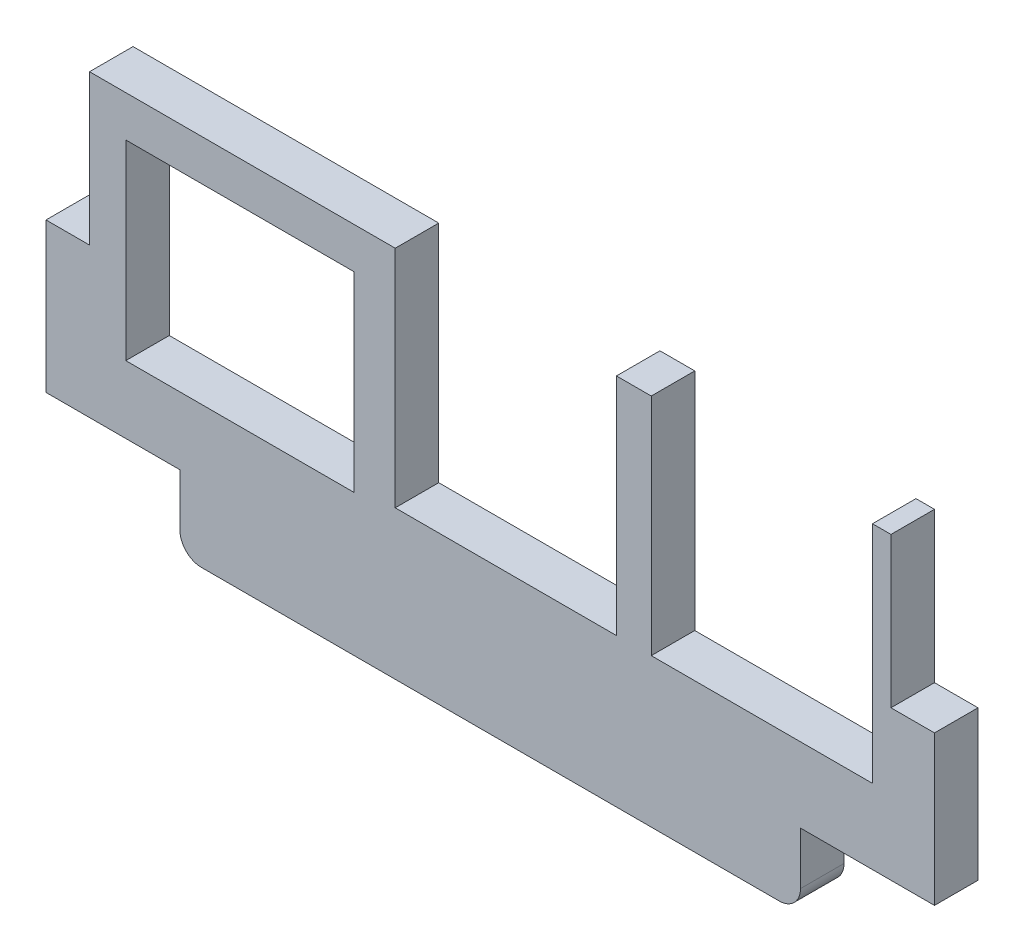
ISO-10303-21;
HEADER;
FILE_DESCRIPTION(('STEP AP214'),'2;1');
FILE_NAME('part.step','',(''),(''),'','','');
FILE_SCHEMA(('AUTOMOTIVE_DESIGN { 1 0 10303 214 1 1 1 1 }'));
ENDSEC;
DATA;
#1=APPLICATION_CONTEXT('core data for automotive mechanical design processes');
#2=APPLICATION_PROTOCOL_DEFINITION('international standard','automotive_design',2000,#1);
#3=PRODUCT_CONTEXT('',#1,'mechanical');
#4=PRODUCT('Part','Part','',(#3));
#5=PRODUCT_RELATED_PRODUCT_CATEGORY('part','',(#4));
#6=PRODUCT_DEFINITION_FORMATION('','',#4);
#7=PRODUCT_DEFINITION_CONTEXT('part definition',#1,'design');
#8=PRODUCT_DEFINITION('design','',#6,#7);
#9=PRODUCT_DEFINITION_SHAPE('','',#8);
#10=(LENGTH_UNIT() NAMED_UNIT(*) SI_UNIT(.MILLI.,.METRE.));
#11=(NAMED_UNIT(*) PLANE_ANGLE_UNIT() SI_UNIT($,.RADIAN.));
#12=(NAMED_UNIT(*) SI_UNIT($,.STERADIAN.) SOLID_ANGLE_UNIT());
#13=UNCERTAINTY_MEASURE_WITH_UNIT(LENGTH_MEASURE(1.E-05),#10,'distance_accuracy_value','');
#14=(GEOMETRIC_REPRESENTATION_CONTEXT(3) GLOBAL_UNCERTAINTY_ASSIGNED_CONTEXT((#13)) GLOBAL_UNIT_ASSIGNED_CONTEXT((#10,
#11,#12)) REPRESENTATION_CONTEXT('',''));
#15=CARTESIAN_POINT('',(0.,0.,0.));
#16=DIRECTION('',(0.,0.,1.));
#17=DIRECTION('',(1.,0.,0.));
#18=AXIS2_PLACEMENT_3D('',#15,#16,#17);
#19=CARTESIAN_POINT('',(51.3469998333009,1.5,3.048));
#20=DIRECTION('',(0.,0.,1.));
#21=DIRECTION('',(1.,0.,0.));
#22=AXIS2_PLACEMENT_3D('',#19,#20,#21);
#23=PLANE('',#22);
#24=CARTESIAN_POINT('',(51.3469998333009,1.5,3.048));
#25=DIRECTION('',(0.,0.,1.));
#26=DIRECTION('',(1.,0.,0.));
#27=AXIS2_PLACEMENT_3D('',#24,#25,#26);
#28=CIRCLE('',#27,1.5);
#29=CARTESIAN_POINT('',(51.3469998333009,0.,3.048));
#30=VERTEX_POINT('',#29);
#31=CARTESIAN_POINT('',(52.8469998333009,1.5,3.048));
#32=VERTEX_POINT('',#31);
#33=EDGE_CURVE('E242',#30,#32,#28,.T.);
#34=ORIENTED_EDGE('',*,*,#33,.T.);
#35=DIRECTION('',(0.,1.,0.));
#36=VECTOR('',#35,1.);
#37=CARTESIAN_POINT('',(52.8469998333009,1.5,3.048));
#38=LINE('',#37,#36);
#39=CARTESIAN_POINT('',(52.8469998333009,5.17000000000001,3.048));
#40=VERTEX_POINT('',#39);
#41=EDGE_CURVE('E245',#32,#40,#38,.T.);
#42=ORIENTED_EDGE('',*,*,#41,.T.);
#43=DIRECTION('',(1.,0.,0.));
#44=VECTOR('',#43,1.);
#45=CARTESIAN_POINT('',(52.8469998333009,5.17000000000001,3.048));
#46=LINE('',#45,#44);
#47=CARTESIAN_POINT('',(62.2299993410707,5.17000000000001,3.048));
#48=VERTEX_POINT('',#47);
#49=EDGE_CURVE('E248',#40,#48,#46,.T.);
#50=ORIENTED_EDGE('',*,*,#49,.T.);
#51=DIRECTION('',(0.,1.,0.));
#52=VECTOR('',#51,1.);
#53=CARTESIAN_POINT('',(62.2299993410707,5.17000000000001,3.048));
#54=LINE('',#53,#52);
#55=CARTESIAN_POINT('',(62.2299993410707,15.6347999396548,3.048));
#56=VERTEX_POINT('',#55);
#57=EDGE_CURVE('E250',#48,#56,#54,.T.);
#58=ORIENTED_EDGE('',*,*,#57,.T.);
#59=DIRECTION('',(-1.,0.,0.));
#60=VECTOR('',#59,1.);
#61=CARTESIAN_POINT('',(62.2299993410707,15.6347999396548,3.048));
#62=LINE('',#61,#60);
#63=CARTESIAN_POINT('',(59.1820003464818,15.6347999396548,3.048));
#64=VERTEX_POINT('',#63);
#65=EDGE_CURVE('E252',#56,#64,#62,.T.);
#66=ORIENTED_EDGE('',*,*,#65,.T.);
#67=DIRECTION('',(0.,1.,0.));
#68=VECTOR('',#67,1.);
#69=CARTESIAN_POINT('',(59.1820003464818,15.6347999396548,3.048));
#70=LINE('',#69,#68);
#71=CARTESIAN_POINT('',(59.1820003464818,26.1503994512186,3.048));
#72=VERTEX_POINT('',#71);
#73=EDGE_CURVE('E254',#64,#72,#70,.T.);
#74=ORIENTED_EDGE('',*,*,#73,.T.);
#75=DIRECTION('',(-1.,0.,0.));
#76=VECTOR('',#75,1.);
#77=CARTESIAN_POINT('',(59.1820003464818,26.1503994512186,3.048));
#78=LINE('',#77,#76);
#79=CARTESIAN_POINT('',(57.8866014257073,26.1503994512186,3.048));
#80=VERTEX_POINT('',#79);
#81=EDGE_CURVE('E256',#72,#80,#78,.T.);
#82=ORIENTED_EDGE('',*,*,#81,.T.);
#83=DIRECTION('',(0.,-1.,0.));
#84=VECTOR('',#83,1.);
#85=CARTESIAN_POINT('',(57.8866014257073,26.1503994512186,3.048));
#86=LINE('',#85,#84);
#87=CARTESIAN_POINT('',(57.8866014257073,10.4024001444504,3.048));
#88=VERTEX_POINT('',#87);
#89=EDGE_CURVE('E258',#80,#88,#86,.T.);
#90=ORIENTED_EDGE('',*,*,#89,.T.);
#91=DIRECTION('',(-1.,0.,0.));
#92=VECTOR('',#91,1.);
#93=CARTESIAN_POINT('',(57.8866014257073,10.4024001444504,3.048));
#94=LINE('',#93,#92);
#95=CARTESIAN_POINT('',(42.3926012590528,10.4024001444504,3.048));
#96=VERTEX_POINT('',#95);
#97=EDGE_CURVE('E260',#88,#96,#94,.T.);
#98=ORIENTED_EDGE('',*,*,#97,.T.);
#99=DIRECTION('',(0.,1.,0.));
#100=VECTOR('',#99,1.);
#101=CARTESIAN_POINT('',(42.3926012590528,10.4024001444504,3.048));
#102=LINE('',#101,#100);
#103=CARTESIAN_POINT('',(42.3926012590528,26.1503994512186,3.048));
#104=VERTEX_POINT('',#103);
#105=EDGE_CURVE('E262',#96,#104,#102,.T.);
#106=ORIENTED_EDGE('',*,*,#105,.T.);
#107=DIRECTION('',(-1.,0.,0.));
#108=VECTOR('',#107,1.);
#109=CARTESIAN_POINT('',(42.3926012590528,26.1503994512186,3.048));
#110=LINE('',#109,#108);
#111=CARTESIAN_POINT('',(39.9542013183236,26.1503994512186,3.048));
#112=VERTEX_POINT('',#111);
#113=EDGE_CURVE('E264',#104,#112,#110,.T.);
#114=ORIENTED_EDGE('',*,*,#113,.T.);
#115=DIRECTION('',(0.,-1.,0.));
#116=VECTOR('',#115,1.);
#117=CARTESIAN_POINT('',(39.9542013183236,26.1503994512186,3.048));
#118=LINE('',#117,#116);
#119=CARTESIAN_POINT('',(39.9542013183236,10.4024001444504,3.048));
#120=VERTEX_POINT('',#119);
#121=EDGE_CURVE('E266',#112,#120,#118,.T.);
#122=ORIENTED_EDGE('',*,*,#121,.T.);
#123=DIRECTION('',(-1.,0.,0.));
#124=VECTOR('',#123,1.);
#125=CARTESIAN_POINT('',(39.9542013183236,10.4024001444504,3.048));
#126=LINE('',#125,#124);
#127=CARTESIAN_POINT('',(24.4601992890239,10.4024001444504,3.048));
#128=VERTEX_POINT('',#127);
#129=EDGE_CURVE('E268',#120,#128,#126,.T.);
#130=ORIENTED_EDGE('',*,*,#129,.T.);
#131=DIRECTION('',(0.,1.,0.));
#132=VECTOR('',#131,1.);
#133=CARTESIAN_POINT('',(24.4601992890239,10.4024001444504,3.048));
#134=LINE('',#133,#132);
#135=CARTESIAN_POINT('',(24.4601992890239,26.1503994512186,3.048));
#136=VERTEX_POINT('',#135);
#137=EDGE_CURVE('E270',#128,#136,#134,.T.);
#138=ORIENTED_EDGE('',*,*,#137,.T.);
#139=DIRECTION('',(-1.,0.,0.));
#140=VECTOR('',#139,1.);
#141=CARTESIAN_POINT('',(24.4601992890239,26.1503994512186,3.048));
#142=LINE('',#141,#140);
#143=CARTESIAN_POINT('',(3.04799992591143,26.1503994512186,3.048));
#144=VERTEX_POINT('',#143);
#145=EDGE_CURVE('E272',#136,#144,#142,.T.);
#146=ORIENTED_EDGE('',*,*,#145,.T.);
#147=DIRECTION('',(0.,-1.,0.));
#148=VECTOR('',#147,1.);
#149=CARTESIAN_POINT('',(3.04799992591143,26.1503994512186,3.048));
#150=LINE('',#149,#148);
#151=CARTESIAN_POINT('',(3.04799992591143,15.6347999396548,3.048));
#152=VERTEX_POINT('',#151);
#153=EDGE_CURVE('E274',#144,#152,#150,.T.);
#154=ORIENTED_EDGE('',*,*,#153,.T.);
#155=DIRECTION('',(-1.,0.,0.));
#156=VECTOR('',#155,1.);
#157=CARTESIAN_POINT('',(3.04799992591143,15.6347999396548,3.048));
#158=LINE('',#157,#156);
#159=CARTESIAN_POINT('',(0.,15.6347999396548,3.048));
#160=VERTEX_POINT('',#159);
#161=EDGE_CURVE('E276',#152,#160,#158,.T.);
#162=ORIENTED_EDGE('',*,*,#161,.T.);
#163=DIRECTION('',(0.,-1.,0.));
#164=VECTOR('',#163,1.);
#165=CARTESIAN_POINT('',(0.,15.6347999396548,3.048));
#166=LINE('',#165,#164);
#167=CARTESIAN_POINT('',(0.,5.17000000000001,3.048));
#168=VERTEX_POINT('',#167);
#169=EDGE_CURVE('E278',#160,#168,#166,.T.);
#170=ORIENTED_EDGE('',*,*,#169,.T.);
#171=DIRECTION('',(1.,0.,0.));
#172=VECTOR('',#171,1.);
#173=CARTESIAN_POINT('',(0.,5.17000000000001,3.048));
#174=LINE('',#173,#172);
#175=CARTESIAN_POINT('',(9.38299975525592,5.17000000000001,3.048));
#176=VERTEX_POINT('',#175);
#177=EDGE_CURVE('E280',#168,#176,#174,.T.);
#178=ORIENTED_EDGE('',*,*,#177,.T.);
#179=DIRECTION('',(0.,-1.,0.));
#180=VECTOR('',#179,1.);
#181=CARTESIAN_POINT('',(9.38299975525592,5.17000000000001,3.048));
#182=LINE('',#181,#180);
#183=CARTESIAN_POINT('',(9.38299975525592,1.5,3.048));
#184=VERTEX_POINT('',#183);
#185=EDGE_CURVE('E282',#176,#184,#182,.T.);
#186=ORIENTED_EDGE('',*,*,#185,.T.);
#187=CARTESIAN_POINT('',(10.8829997552559,1.5,3.048));
#188=DIRECTION('',(0.,0.,1.));
#189=DIRECTION('',(1.,0.,0.));
#190=AXIS2_PLACEMENT_3D('',#187,#188,#189);
#191=CIRCLE('',#190,1.5);
#192=CARTESIAN_POINT('',(10.8829997552559,0.,3.048));
#193=VERTEX_POINT('',#192);
#194=EDGE_CURVE('E284',#184,#193,#191,.T.);
#195=ORIENTED_EDGE('',*,*,#194,.T.);
#196=DIRECTION('',(1.,0.,0.));
#197=VECTOR('',#196,1.);
#198=CARTESIAN_POINT('',(10.8829997552559,0.,3.048));
#199=LINE('',#198,#197);
#200=EDGE_CURVE('E286',#193,#30,#199,.T.);
#201=ORIENTED_EDGE('',*,*,#200,.T.);
#202=EDGE_LOOP('',(#34,#42,#50,#58,#66,#74,#82,#90,#98,#106,#114,#122,#130,#138,#146,#154,#162,
#170,#178,#186,#195,#201));
#203=FACE_BOUND('',#202,.T.);
#204=DIRECTION('',(1.,0.,0.));
#205=VECTOR('',#204,1.);
#206=CARTESIAN_POINT('',(21.5899990871549,9.89440000157804,3.048));
#207=LINE('',#206,#205);
#208=CARTESIAN_POINT('',(5.58799994178116,9.89440000157804,3.048));
#209=VERTEX_POINT('',#208);
#210=CARTESIAN_POINT('',(21.5899990871549,9.89440000157804,3.048));
#211=VERTEX_POINT('',#210);
#212=EDGE_CURVE('E214',#209,#211,#207,.T.);
#213=ORIENTED_EDGE('',*,*,#212,.F.);
#214=DIRECTION('',(0.,-1.,0.));
#215=VECTOR('',#214,1.);
#216=CARTESIAN_POINT('',(5.58799994178116,9.89440000157804,3.048));
#217=LINE('',#216,#215);
#218=CARTESIAN_POINT('',(5.58799994178116,23.2801992493495,3.048));
#219=VERTEX_POINT('',#218);
#220=EDGE_CURVE('E206',#219,#209,#217,.T.);
#221=ORIENTED_EDGE('',*,*,#220,.F.);
#222=DIRECTION('',(-1.,0.,0.));
#223=VECTOR('',#222,1.);
#224=CARTESIAN_POINT('',(5.58799994178116,23.2801992493495,3.048));
#225=LINE('',#224,#223);
#226=CARTESIAN_POINT('',(21.5899990871549,23.2801992493495,3.048));
#227=VERTEX_POINT('',#226);
#228=EDGE_CURVE('E228',#227,#219,#225,.T.);
#229=ORIENTED_EDGE('',*,*,#228,.F.);
#230=DIRECTION('',(0.,1.,0.));
#231=VECTOR('',#230,1.);
#232=CARTESIAN_POINT('',(21.5899990871549,23.2801992493495,3.048));
#233=LINE('',#232,#231);
#234=EDGE_CURVE('E226',#211,#227,#233,.T.);
#235=ORIENTED_EDGE('',*,*,#234,.F.);
#236=EDGE_LOOP('',(#213,#221,#229,#235));
#237=FACE_BOUND('',#236,.T.);
#238=ADVANCED_FACE('F33',(#203,#237),#23,.T.);
#239=CARTESIAN_POINT('',(51.3469998333009,1.5,0.));
#240=DIRECTION('',(0.,0.,1.));
#241=DIRECTION('',(1.,0.,0.));
#242=AXIS2_PLACEMENT_3D('',#239,#240,#241);
#243=PLANE('',#242);
#244=CARTESIAN_POINT('',(51.3469998333009,1.5,0.));
#245=DIRECTION('',(0.,0.,1.));
#246=DIRECTION('',(1.,0.,0.));
#247=AXIS2_PLACEMENT_3D('',#244,#245,#246);
#248=CIRCLE('',#247,1.5);
#249=CARTESIAN_POINT('',(51.3469998333009,0.,0.));
#250=VERTEX_POINT('',#249);
#251=CARTESIAN_POINT('',(52.8469998333009,1.5,0.));
#252=VERTEX_POINT('',#251);
#253=EDGE_CURVE('E222',#250,#252,#248,.T.);
#254=ORIENTED_EDGE('',*,*,#253,.F.);
#255=DIRECTION('',(1.,0.,0.));
#256=VECTOR('',#255,1.);
#257=CARTESIAN_POINT('',(10.8829997552559,0.,0.));
#258=LINE('',#257,#256);
#259=CARTESIAN_POINT('',(10.8829997552559,0.,0.));
#260=VERTEX_POINT('',#259);
#261=EDGE_CURVE('E246',#260,#250,#258,.T.);
#262=ORIENTED_EDGE('',*,*,#261,.F.);
#263=CARTESIAN_POINT('',(10.8829997552559,1.5,0.));
#264=DIRECTION('',(0.,0.,1.));
#265=DIRECTION('',(1.,0.,0.));
#266=AXIS2_PLACEMENT_3D('',#263,#264,#265);
#267=CIRCLE('',#266,1.5);
#268=CARTESIAN_POINT('',(9.38299975525592,1.5,0.));
#269=VERTEX_POINT('',#268);
#270=EDGE_CURVE('E329',#269,#260,#267,.T.);
#271=ORIENTED_EDGE('',*,*,#270,.F.);
#272=DIRECTION('',(0.,-1.,0.));
#273=VECTOR('',#272,1.);
#274=CARTESIAN_POINT('',(9.38299975525592,5.17000000000001,0.));
#275=LINE('',#274,#273);
#276=CARTESIAN_POINT('',(9.38299975525592,5.17000000000001,0.));
#277=VERTEX_POINT('',#276);
#278=EDGE_CURVE('E327',#277,#269,#275,.T.);
#279=ORIENTED_EDGE('',*,*,#278,.F.);
#280=DIRECTION('',(1.,0.,0.));
#281=VECTOR('',#280,1.);
#282=CARTESIAN_POINT('',(0.,5.17000000000001,0.));
#283=LINE('',#282,#281);
#284=CARTESIAN_POINT('',(0.,5.17000000000001,0.));
#285=VERTEX_POINT('',#284);
#286=EDGE_CURVE('E325',#285,#277,#283,.T.);
#287=ORIENTED_EDGE('',*,*,#286,.F.);
#288=DIRECTION('',(0.,-1.,0.));
#289=VECTOR('',#288,1.);
#290=CARTESIAN_POINT('',(0.,15.6347999396548,0.));
#291=LINE('',#290,#289);
#292=CARTESIAN_POINT('',(0.,15.6347999396548,0.));
#293=VERTEX_POINT('',#292);
#294=EDGE_CURVE('E323',#293,#285,#291,.T.);
#295=ORIENTED_EDGE('',*,*,#294,.F.);
#296=DIRECTION('',(-1.,0.,0.));
#297=VECTOR('',#296,1.);
#298=CARTESIAN_POINT('',(3.04799992591143,15.6347999396548,0.));
#299=LINE('',#298,#297);
#300=CARTESIAN_POINT('',(3.04799992591143,15.6347999396548,0.));
#301=VERTEX_POINT('',#300);
#302=EDGE_CURVE('E321',#301,#293,#299,.T.);
#303=ORIENTED_EDGE('',*,*,#302,.F.);
#304=DIRECTION('',(0.,-1.,0.));
#305=VECTOR('',#304,1.);
#306=CARTESIAN_POINT('',(3.04799992591143,26.1503994512186,0.));
#307=LINE('',#306,#305);
#308=CARTESIAN_POINT('',(3.04799992591143,26.1503994512186,0.));
#309=VERTEX_POINT('',#308);
#310=EDGE_CURVE('E319',#309,#301,#307,.T.);
#311=ORIENTED_EDGE('',*,*,#310,.F.);
#312=DIRECTION('',(-1.,0.,0.));
#313=VECTOR('',#312,1.);
#314=CARTESIAN_POINT('',(24.4601992890239,26.1503994512186,0.));
#315=LINE('',#314,#313);
#316=CARTESIAN_POINT('',(24.4601992890239,26.1503994512186,0.));
#317=VERTEX_POINT('',#316);
#318=EDGE_CURVE('E317',#317,#309,#315,.T.);
#319=ORIENTED_EDGE('',*,*,#318,.F.);
#320=DIRECTION('',(0.,1.,0.));
#321=VECTOR('',#320,1.);
#322=CARTESIAN_POINT('',(24.4601992890239,10.4024001444504,0.));
#323=LINE('',#322,#321);
#324=CARTESIAN_POINT('',(24.4601992890239,10.4024001444504,0.));
#325=VERTEX_POINT('',#324);
#326=EDGE_CURVE('E315',#325,#317,#323,.T.);
#327=ORIENTED_EDGE('',*,*,#326,.F.);
#328=DIRECTION('',(-1.,0.,0.));
#329=VECTOR('',#328,1.);
#330=CARTESIAN_POINT('',(39.9542013183236,10.4024001444504,0.));
#331=LINE('',#330,#329);
#332=CARTESIAN_POINT('',(39.9542013183236,10.4024001444504,0.));
#333=VERTEX_POINT('',#332);
#334=EDGE_CURVE('E313',#333,#325,#331,.T.);
#335=ORIENTED_EDGE('',*,*,#334,.F.);
#336=DIRECTION('',(0.,-1.,0.));
#337=VECTOR('',#336,1.);
#338=CARTESIAN_POINT('',(39.9542013183236,26.1503994512186,0.));
#339=LINE('',#338,#337);
#340=CARTESIAN_POINT('',(39.9542013183236,26.1503994512186,0.));
#341=VERTEX_POINT('',#340);
#342=EDGE_CURVE('E311',#341,#333,#339,.T.);
#343=ORIENTED_EDGE('',*,*,#342,.F.);
#344=DIRECTION('',(-1.,0.,0.));
#345=VECTOR('',#344,1.);
#346=CARTESIAN_POINT('',(42.3926012590528,26.1503994512186,0.));
#347=LINE('',#346,#345);
#348=CARTESIAN_POINT('',(42.3926012590528,26.1503994512186,0.));
#349=VERTEX_POINT('',#348);
#350=EDGE_CURVE('E309',#349,#341,#347,.T.);
#351=ORIENTED_EDGE('',*,*,#350,.F.);
#352=DIRECTION('',(0.,1.,0.));
#353=VECTOR('',#352,1.);
#354=CARTESIAN_POINT('',(42.3926012590528,10.4024001444504,0.));
#355=LINE('',#354,#353);
#356=CARTESIAN_POINT('',(42.3926012590528,10.4024001444504,0.));
#357=VERTEX_POINT('',#356);
#358=EDGE_CURVE('E307',#357,#349,#355,.T.);
#359=ORIENTED_EDGE('',*,*,#358,.F.);
#360=DIRECTION('',(-1.,0.,0.));
#361=VECTOR('',#360,1.);
#362=CARTESIAN_POINT('',(57.8866014257073,10.4024001444504,0.));
#363=LINE('',#362,#361);
#364=CARTESIAN_POINT('',(57.8866014257073,10.4024001444504,0.));
#365=VERTEX_POINT('',#364);
#366=EDGE_CURVE('E305',#365,#357,#363,.T.);
#367=ORIENTED_EDGE('',*,*,#366,.F.);
#368=DIRECTION('',(0.,-1.,0.));
#369=VECTOR('',#368,1.);
#370=CARTESIAN_POINT('',(57.8866014257073,26.1503994512186,0.));
#371=LINE('',#370,#369);
#372=CARTESIAN_POINT('',(57.8866014257073,26.1503994512186,0.));
#373=VERTEX_POINT('',#372);
#374=EDGE_CURVE('E303',#373,#365,#371,.T.);
#375=ORIENTED_EDGE('',*,*,#374,.F.);
#376=DIRECTION('',(-1.,0.,0.));
#377=VECTOR('',#376,1.);
#378=CARTESIAN_POINT('',(59.1820003464818,26.1503994512186,0.));
#379=LINE('',#378,#377);
#380=CARTESIAN_POINT('',(59.1820003464818,26.1503994512186,0.));
#381=VERTEX_POINT('',#380);
#382=EDGE_CURVE('E301',#381,#373,#379,.T.);
#383=ORIENTED_EDGE('',*,*,#382,.F.);
#384=DIRECTION('',(0.,1.,0.));
#385=VECTOR('',#384,1.);
#386=CARTESIAN_POINT('',(59.1820003464818,15.6347999396548,0.));
#387=LINE('',#386,#385);
#388=CARTESIAN_POINT('',(59.1820003464818,15.6347999396548,0.));
#389=VERTEX_POINT('',#388);
#390=EDGE_CURVE('E299',#389,#381,#387,.T.);
#391=ORIENTED_EDGE('',*,*,#390,.F.);
#392=DIRECTION('',(-1.,0.,0.));
#393=VECTOR('',#392,1.);
#394=CARTESIAN_POINT('',(62.2299993410707,15.6347999396548,0.));
#395=LINE('',#394,#393);
#396=CARTESIAN_POINT('',(62.2299993410707,15.6347999396548,0.));
#397=VERTEX_POINT('',#396);
#398=EDGE_CURVE('E297',#397,#389,#395,.T.);
#399=ORIENTED_EDGE('',*,*,#398,.F.);
#400=DIRECTION('',(0.,1.,0.));
#401=VECTOR('',#400,1.);
#402=CARTESIAN_POINT('',(62.2299993410707,5.17000000000001,0.));
#403=LINE('',#402,#401);
#404=CARTESIAN_POINT('',(62.2299993410707,5.17000000000001,0.));
#405=VERTEX_POINT('',#404);
#406=EDGE_CURVE('E295',#405,#397,#403,.T.);
#407=ORIENTED_EDGE('',*,*,#406,.F.);
#408=DIRECTION('',(1.,0.,0.));
#409=VECTOR('',#408,1.);
#410=CARTESIAN_POINT('',(52.8469998333009,5.17000000000001,0.));
#411=LINE('',#410,#409);
#412=CARTESIAN_POINT('',(52.8469998333009,5.17000000000001,0.));
#413=VERTEX_POINT('',#412);
#414=EDGE_CURVE('E293',#413,#405,#411,.T.);
#415=ORIENTED_EDGE('',*,*,#414,.F.);
#416=DIRECTION('',(0.,1.,0.));
#417=VECTOR('',#416,1.);
#418=CARTESIAN_POINT('',(52.8469998333009,1.5,0.));
#419=LINE('',#418,#417);
#420=EDGE_CURVE('E291',#252,#413,#419,.T.);
#421=ORIENTED_EDGE('',*,*,#420,.F.);
#422=EDGE_LOOP('',(#254,#262,#271,#279,#287,#295,#303,#311,#319,#327,#335,#343,#351,#359,#367,
#375,#383,#391,#399,#407,#415,#421));
#423=FACE_BOUND('',#422,.T.);
#424=DIRECTION('',(0.,-1.,0.));
#425=VECTOR('',#424,1.);
#426=CARTESIAN_POINT('',(5.58799994178116,9.89440000157804,0.));
#427=LINE('',#426,#425);
#428=CARTESIAN_POINT('',(5.58799994178116,23.2801992493495,0.));
#429=VERTEX_POINT('',#428);
#430=CARTESIAN_POINT('',(5.58799994178116,9.89440000157804,0.));
#431=VERTEX_POINT('',#430);
#432=EDGE_CURVE('E56',#429,#431,#427,.T.);
#433=ORIENTED_EDGE('',*,*,#432,.T.);
#434=DIRECTION('',(1.,0.,0.));
#435=VECTOR('',#434,1.);
#436=CARTESIAN_POINT('',(21.5899990871549,9.89440000157804,0.));
#437=LINE('',#436,#435);
#438=CARTESIAN_POINT('',(21.5899990871549,9.89440000157804,0.));
#439=VERTEX_POINT('',#438);
#440=EDGE_CURVE('E221',#431,#439,#437,.T.);
#441=ORIENTED_EDGE('',*,*,#440,.T.);
#442=DIRECTION('',(0.,1.,0.));
#443=VECTOR('',#442,1.);
#444=CARTESIAN_POINT('',(21.5899990871549,23.2801992493495,0.));
#445=LINE('',#444,#443);
#446=CARTESIAN_POINT('',(21.5899990871549,23.2801992493495,0.));
#447=VERTEX_POINT('',#446);
#448=EDGE_CURVE('E234',#439,#447,#445,.T.);
#449=ORIENTED_EDGE('',*,*,#448,.T.);
#450=DIRECTION('',(-1.,0.,0.));
#451=VECTOR('',#450,1.);
#452=CARTESIAN_POINT('',(5.58799994178116,23.2801992493495,0.));
#453=LINE('',#452,#451);
#454=EDGE_CURVE('E215',#447,#429,#453,.T.);
#455=ORIENTED_EDGE('',*,*,#454,.T.);
#456=EDGE_LOOP('',(#433,#441,#449,#455));
#457=FACE_BOUND('',#456,.T.);
#458=ADVANCED_FACE('F401',(#423,#457),#243,.F.);
#459=CARTESIAN_POINT('',(51.3469998333009,1.5,3.048));
#460=DIRECTION('',(0.,0.,-1.));
#461=DIRECTION('',(-1.,0.,0.));
#462=AXIS2_PLACEMENT_3D('',#459,#460,#461);
#463=CYLINDRICAL_SURFACE('',#462,1.5);
#464=ORIENTED_EDGE('',*,*,#253,.T.);
#465=DIRECTION('',(0.,0.,-1.));
#466=VECTOR('',#465,1.);
#467=CARTESIAN_POINT('',(52.8469998333009,1.5,3.048));
#468=LINE('',#467,#466);
#469=EDGE_CURVE('E11',#32,#252,#468,.T.);
#470=ORIENTED_EDGE('',*,*,#469,.F.);
#471=ORIENTED_EDGE('',*,*,#33,.F.);
#472=DIRECTION('',(0.,0.,-1.));
#473=VECTOR('',#472,1.);
#474=CARTESIAN_POINT('',(51.3469998333009,0.,3.048));
#475=LINE('',#474,#473);
#476=EDGE_CURVE('E288',#30,#250,#475,.T.);
#477=ORIENTED_EDGE('',*,*,#476,.T.);
#478=EDGE_LOOP('',(#464,#470,#471,#477));
#479=FACE_BOUND('',#478,.T.);
#480=ADVANCED_FACE('F35',(#479),#463,.T.);
#481=CARTESIAN_POINT('',(52.8469998333009,1.5,3.048));
#482=DIRECTION('',(-1.,0.,0.));
#483=DIRECTION('',(0.,0.,1.));
#484=AXIS2_PLACEMENT_3D('',#481,#482,#483);
#485=PLANE('',#484);
#486=ORIENTED_EDGE('',*,*,#420,.T.);
#487=DIRECTION('',(0.,0.,-1.));
#488=VECTOR('',#487,1.);
#489=CARTESIAN_POINT('',(52.8469998333009,5.17000000000001,3.048));
#490=LINE('',#489,#488);
#491=EDGE_CURVE('E41',#40,#413,#490,.T.);
#492=ORIENTED_EDGE('',*,*,#491,.F.);
#493=ORIENTED_EDGE('',*,*,#41,.F.);
#494=ORIENTED_EDGE('',*,*,#469,.T.);
#495=EDGE_LOOP('',(#486,#492,#493,#494));
#496=FACE_BOUND('',#495,.T.);
#497=ADVANCED_FACE('F418',(#496),#485,.F.);
#498=CARTESIAN_POINT('',(52.8469998333009,5.17000000000001,3.048));
#499=DIRECTION('',(0.,1.,0.));
#500=DIRECTION('',(0.,0.,1.));
#501=AXIS2_PLACEMENT_3D('',#498,#499,#500);
#502=PLANE('',#501);
#503=ORIENTED_EDGE('',*,*,#414,.T.);
#504=DIRECTION('',(0.,0.,-1.));
#505=VECTOR('',#504,1.);
#506=CARTESIAN_POINT('',(62.2299993410707,5.17000000000001,3.048));
#507=LINE('',#506,#505);
#508=EDGE_CURVE('E388',#48,#405,#507,.T.);
#509=ORIENTED_EDGE('',*,*,#508,.F.);
#510=ORIENTED_EDGE('',*,*,#49,.F.);
#511=ORIENTED_EDGE('',*,*,#491,.T.);
#512=EDGE_LOOP('',(#503,#509,#510,#511));
#513=FACE_BOUND('',#512,.T.);
#514=ADVANCED_FACE('F395',(#513),#502,.F.);
#515=CARTESIAN_POINT('',(62.2299993410707,5.17000000000001,3.048));
#516=DIRECTION('',(-1.,0.,0.));
#517=DIRECTION('',(0.,0.,1.));
#518=AXIS2_PLACEMENT_3D('',#515,#516,#517);
#519=PLANE('',#518);
#520=ORIENTED_EDGE('',*,*,#406,.T.);
#521=DIRECTION('',(0.,0.,-1.));
#522=VECTOR('',#521,1.);
#523=CARTESIAN_POINT('',(62.2299993410707,15.6347999396548,3.048));
#524=LINE('',#523,#522);
#525=EDGE_CURVE('E385',#56,#397,#524,.T.);
#526=ORIENTED_EDGE('',*,*,#525,.F.);
#527=ORIENTED_EDGE('',*,*,#57,.F.);
#528=ORIENTED_EDGE('',*,*,#508,.T.);
#529=EDGE_LOOP('',(#520,#526,#527,#528));
#530=FACE_BOUND('',#529,.T.);
#531=ADVANCED_FACE('F407',(#530),#519,.F.);
#532=CARTESIAN_POINT('',(62.2299993410707,15.6347999396548,3.048));
#533=DIRECTION('',(0.,-1.,0.));
#534=DIRECTION('',(0.,0.,-1.));
#535=AXIS2_PLACEMENT_3D('',#532,#533,#534);
#536=PLANE('',#535);
#537=ORIENTED_EDGE('',*,*,#398,.T.);
#538=DIRECTION('',(0.,0.,-1.));
#539=VECTOR('',#538,1.);
#540=CARTESIAN_POINT('',(59.1820003464818,15.6347999396548,3.048));
#541=LINE('',#540,#539);
#542=EDGE_CURVE('E382',#64,#389,#541,.T.);
#543=ORIENTED_EDGE('',*,*,#542,.F.);
#544=ORIENTED_EDGE('',*,*,#65,.F.);
#545=ORIENTED_EDGE('',*,*,#525,.T.);
#546=EDGE_LOOP('',(#537,#543,#544,#545));
#547=FACE_BOUND('',#546,.T.);
#548=ADVANCED_FACE('F411',(#547),#536,.F.);
#549=CARTESIAN_POINT('',(59.1820003464818,15.6347999396548,3.048));
#550=DIRECTION('',(-1.,0.,0.));
#551=DIRECTION('',(0.,0.,1.));
#552=AXIS2_PLACEMENT_3D('',#549,#550,#551);
#553=PLANE('',#552);
#554=ORIENTED_EDGE('',*,*,#390,.T.);
#555=DIRECTION('',(0.,0.,-1.));
#556=VECTOR('',#555,1.);
#557=CARTESIAN_POINT('',(59.1820003464818,26.1503994512186,3.048));
#558=LINE('',#557,#556);
#559=EDGE_CURVE('E379',#72,#381,#558,.T.);
#560=ORIENTED_EDGE('',*,*,#559,.F.);
#561=ORIENTED_EDGE('',*,*,#73,.F.);
#562=ORIENTED_EDGE('',*,*,#542,.T.);
#563=EDGE_LOOP('',(#554,#560,#561,#562));
#564=FACE_BOUND('',#563,.T.);
#565=ADVANCED_FACE('F501',(#564),#553,.F.);
#566=CARTESIAN_POINT('',(59.1820003464818,26.1503994512186,3.048));
#567=DIRECTION('',(0.,-1.,0.));
#568=DIRECTION('',(0.,0.,-1.));
#569=AXIS2_PLACEMENT_3D('',#566,#567,#568);
#570=PLANE('',#569);
#571=ORIENTED_EDGE('',*,*,#382,.T.);
#572=DIRECTION('',(0.,0.,-1.));
#573=VECTOR('',#572,1.);
#574=CARTESIAN_POINT('',(57.8866014257073,26.1503994512186,3.048));
#575=LINE('',#574,#573);
#576=EDGE_CURVE('E376',#80,#373,#575,.T.);
#577=ORIENTED_EDGE('',*,*,#576,.F.);
#578=ORIENTED_EDGE('',*,*,#81,.F.);
#579=ORIENTED_EDGE('',*,*,#559,.T.);
#580=EDGE_LOOP('',(#571,#577,#578,#579));
#581=FACE_BOUND('',#580,.T.);
#582=ADVANCED_FACE('F498',(#581),#570,.F.);
#583=CARTESIAN_POINT('',(57.8866014257073,26.1503994512186,3.048));
#584=DIRECTION('',(1.,0.,0.));
#585=DIRECTION('',(0.,0.,-1.));
#586=AXIS2_PLACEMENT_3D('',#583,#584,#585);
#587=PLANE('',#586);
#588=ORIENTED_EDGE('',*,*,#374,.T.);
#589=DIRECTION('',(0.,0.,-1.));
#590=VECTOR('',#589,1.);
#591=CARTESIAN_POINT('',(57.8866014257073,10.4024001444504,3.048));
#592=LINE('',#591,#590);
#593=EDGE_CURVE('E373',#88,#365,#592,.T.);
#594=ORIENTED_EDGE('',*,*,#593,.F.);
#595=ORIENTED_EDGE('',*,*,#89,.F.);
#596=ORIENTED_EDGE('',*,*,#576,.T.);
#597=EDGE_LOOP('',(#588,#594,#595,#596));
#598=FACE_BOUND('',#597,.T.);
#599=ADVANCED_FACE('F494',(#598),#587,.F.);
#600=CARTESIAN_POINT('',(57.8866014257073,10.4024001444504,3.048));
#601=DIRECTION('',(0.,-1.,0.));
#602=DIRECTION('',(0.,0.,-1.));
#603=AXIS2_PLACEMENT_3D('',#600,#601,#602);
#604=PLANE('',#603);
#605=ORIENTED_EDGE('',*,*,#366,.T.);
#606=DIRECTION('',(0.,0.,-1.));
#607=VECTOR('',#606,1.);
#608=CARTESIAN_POINT('',(42.3926012590528,10.4024001444504,3.048));
#609=LINE('',#608,#607);
#610=EDGE_CURVE('E370',#96,#357,#609,.T.);
#611=ORIENTED_EDGE('',*,*,#610,.F.);
#612=ORIENTED_EDGE('',*,*,#97,.F.);
#613=ORIENTED_EDGE('',*,*,#593,.T.);
#614=EDGE_LOOP('',(#605,#611,#612,#613));
#615=FACE_BOUND('',#614,.T.);
#616=ADVANCED_FACE('F490',(#615),#604,.F.);
#617=CARTESIAN_POINT('',(42.3926012590528,10.4024001444504,3.048));
#618=DIRECTION('',(-1.,0.,0.));
#619=DIRECTION('',(0.,0.,1.));
#620=AXIS2_PLACEMENT_3D('',#617,#618,#619);
#621=PLANE('',#620);
#622=ORIENTED_EDGE('',*,*,#358,.T.);
#623=DIRECTION('',(0.,0.,-1.));
#624=VECTOR('',#623,1.);
#625=CARTESIAN_POINT('',(42.3926012590528,26.1503994512186,3.048));
#626=LINE('',#625,#624);
#627=EDGE_CURVE('E367',#104,#349,#626,.T.);
#628=ORIENTED_EDGE('',*,*,#627,.F.);
#629=ORIENTED_EDGE('',*,*,#105,.F.);
#630=ORIENTED_EDGE('',*,*,#610,.T.);
#631=EDGE_LOOP('',(#622,#628,#629,#630));
#632=FACE_BOUND('',#631,.T.);
#633=ADVANCED_FACE('F485',(#632),#621,.F.);
#634=CARTESIAN_POINT('',(42.3926012590528,26.1503994512186,3.048));
#635=DIRECTION('',(0.,-1.,0.));
#636=DIRECTION('',(0.,0.,-1.));
#637=AXIS2_PLACEMENT_3D('',#634,#635,#636);
#638=PLANE('',#637);
#639=ORIENTED_EDGE('',*,*,#350,.T.);
#640=DIRECTION('',(0.,0.,-1.));
#641=VECTOR('',#640,1.);
#642=CARTESIAN_POINT('',(39.9542013183236,26.1503994512186,3.048));
#643=LINE('',#642,#641);
#644=EDGE_CURVE('E364',#112,#341,#643,.T.);
#645=ORIENTED_EDGE('',*,*,#644,.F.);
#646=ORIENTED_EDGE('',*,*,#113,.F.);
#647=ORIENTED_EDGE('',*,*,#627,.T.);
#648=EDGE_LOOP('',(#639,#645,#646,#647));
#649=FACE_BOUND('',#648,.T.);
#650=ADVANCED_FACE('F479',(#649),#638,.F.);
#651=CARTESIAN_POINT('',(39.9542013183236,26.1503994512186,3.048));
#652=DIRECTION('',(1.,0.,0.));
#653=DIRECTION('',(0.,0.,-1.));
#654=AXIS2_PLACEMENT_3D('',#651,#652,#653);
#655=PLANE('',#654);
#656=ORIENTED_EDGE('',*,*,#342,.T.);
#657=DIRECTION('',(0.,0.,-1.));
#658=VECTOR('',#657,1.);
#659=CARTESIAN_POINT('',(39.9542013183236,10.4024001444504,3.048));
#660=LINE('',#659,#658);
#661=EDGE_CURVE('E361',#120,#333,#660,.T.);
#662=ORIENTED_EDGE('',*,*,#661,.F.);
#663=ORIENTED_EDGE('',*,*,#121,.F.);
#664=ORIENTED_EDGE('',*,*,#644,.T.);
#665=EDGE_LOOP('',(#656,#662,#663,#664));
#666=FACE_BOUND('',#665,.T.);
#667=ADVANCED_FACE('F475',(#666),#655,.F.);
#668=CARTESIAN_POINT('',(39.9542013183236,10.4024001444504,3.048));
#669=DIRECTION('',(0.,-1.,0.));
#670=DIRECTION('',(0.,0.,-1.));
#671=AXIS2_PLACEMENT_3D('',#668,#669,#670);
#672=PLANE('',#671);
#673=ORIENTED_EDGE('',*,*,#334,.T.);
#674=DIRECTION('',(0.,0.,-1.));
#675=VECTOR('',#674,1.);
#676=CARTESIAN_POINT('',(24.4601992890239,10.4024001444504,3.048));
#677=LINE('',#676,#675);
#678=EDGE_CURVE('E358',#128,#325,#677,.T.);
#679=ORIENTED_EDGE('',*,*,#678,.F.);
#680=ORIENTED_EDGE('',*,*,#129,.F.);
#681=ORIENTED_EDGE('',*,*,#661,.T.);
#682=EDGE_LOOP('',(#673,#679,#680,#681));
#683=FACE_BOUND('',#682,.T.);
#684=ADVANCED_FACE('F470',(#683),#672,.F.);
#685=CARTESIAN_POINT('',(24.4601992890239,10.4024001444504,3.048));
#686=DIRECTION('',(-1.,0.,0.));
#687=DIRECTION('',(0.,0.,1.));
#688=AXIS2_PLACEMENT_3D('',#685,#686,#687);
#689=PLANE('',#688);
#690=ORIENTED_EDGE('',*,*,#326,.T.);
#691=DIRECTION('',(0.,0.,-1.));
#692=VECTOR('',#691,1.);
#693=CARTESIAN_POINT('',(24.4601992890239,26.1503994512186,3.048));
#694=LINE('',#693,#692);
#695=EDGE_CURVE('E355',#136,#317,#694,.T.);
#696=ORIENTED_EDGE('',*,*,#695,.F.);
#697=ORIENTED_EDGE('',*,*,#137,.F.);
#698=ORIENTED_EDGE('',*,*,#678,.T.);
#699=EDGE_LOOP('',(#690,#696,#697,#698));
#700=FACE_BOUND('',#699,.T.);
#701=ADVANCED_FACE('F464',(#700),#689,.F.);
#702=CARTESIAN_POINT('',(24.4601992890239,26.1503994512186,3.048));
#703=DIRECTION('',(0.,-1.,0.));
#704=DIRECTION('',(0.,0.,-1.));
#705=AXIS2_PLACEMENT_3D('',#702,#703,#704);
#706=PLANE('',#705);
#707=ORIENTED_EDGE('',*,*,#318,.T.);
#708=DIRECTION('',(0.,0.,-1.));
#709=VECTOR('',#708,1.);
#710=CARTESIAN_POINT('',(3.04799992591143,26.1503994512186,3.048));
#711=LINE('',#710,#709);
#712=EDGE_CURVE('E352',#144,#309,#711,.T.);
#713=ORIENTED_EDGE('',*,*,#712,.F.);
#714=ORIENTED_EDGE('',*,*,#145,.F.);
#715=ORIENTED_EDGE('',*,*,#695,.T.);
#716=EDGE_LOOP('',(#707,#713,#714,#715));
#717=FACE_BOUND('',#716,.T.);
#718=ADVANCED_FACE('F460',(#717),#706,.F.);
#719=CARTESIAN_POINT('',(3.04799992591143,26.1503994512186,3.048));
#720=DIRECTION('',(1.,0.,0.));
#721=DIRECTION('',(0.,0.,-1.));
#722=AXIS2_PLACEMENT_3D('',#719,#720,#721);
#723=PLANE('',#722);
#724=ORIENTED_EDGE('',*,*,#310,.T.);
#725=DIRECTION('',(0.,0.,-1.));
#726=VECTOR('',#725,1.);
#727=CARTESIAN_POINT('',(3.04799992591143,15.6347999396548,3.048));
#728=LINE('',#727,#726);
#729=EDGE_CURVE('E349',#152,#301,#728,.T.);
#730=ORIENTED_EDGE('',*,*,#729,.F.);
#731=ORIENTED_EDGE('',*,*,#153,.F.);
#732=ORIENTED_EDGE('',*,*,#712,.T.);
#733=EDGE_LOOP('',(#724,#730,#731,#732));
#734=FACE_BOUND('',#733,.T.);
#735=ADVANCED_FACE('F455',(#734),#723,.F.);
#736=CARTESIAN_POINT('',(3.04799992591143,15.6347999396548,3.048));
#737=DIRECTION('',(0.,-1.,0.));
#738=DIRECTION('',(0.,0.,-1.));
#739=AXIS2_PLACEMENT_3D('',#736,#737,#738);
#740=PLANE('',#739);
#741=ORIENTED_EDGE('',*,*,#302,.T.);
#742=DIRECTION('',(0.,0.,-1.));
#743=VECTOR('',#742,1.);
#744=CARTESIAN_POINT('',(0.,15.6347999396548,3.048));
#745=LINE('',#744,#743);
#746=EDGE_CURVE('E346',#160,#293,#745,.T.);
#747=ORIENTED_EDGE('',*,*,#746,.F.);
#748=ORIENTED_EDGE('',*,*,#161,.F.);
#749=ORIENTED_EDGE('',*,*,#729,.T.);
#750=EDGE_LOOP('',(#741,#747,#748,#749));
#751=FACE_BOUND('',#750,.T.);
#752=ADVANCED_FACE('F449',(#751),#740,.F.);
#753=CARTESIAN_POINT('',(0.,15.6347999396548,3.048));
#754=DIRECTION('',(1.,0.,0.));
#755=DIRECTION('',(0.,0.,-1.));
#756=AXIS2_PLACEMENT_3D('',#753,#754,#755);
#757=PLANE('',#756);
#758=ORIENTED_EDGE('',*,*,#294,.T.);
#759=DIRECTION('',(0.,0.,-1.));
#760=VECTOR('',#759,1.);
#761=CARTESIAN_POINT('',(0.,5.17000000000001,3.048));
#762=LINE('',#761,#760);
#763=EDGE_CURVE('E343',#168,#285,#762,.T.);
#764=ORIENTED_EDGE('',*,*,#763,.F.);
#765=ORIENTED_EDGE('',*,*,#169,.F.);
#766=ORIENTED_EDGE('',*,*,#746,.T.);
#767=EDGE_LOOP('',(#758,#764,#765,#766));
#768=FACE_BOUND('',#767,.T.);
#769=ADVANCED_FACE('F445',(#768),#757,.F.);
#770=CARTESIAN_POINT('',(0.,5.17000000000001,3.048));
#771=DIRECTION('',(0.,1.,0.));
#772=DIRECTION('',(0.,0.,1.));
#773=AXIS2_PLACEMENT_3D('',#770,#771,#772);
#774=PLANE('',#773);
#775=ORIENTED_EDGE('',*,*,#286,.T.);
#776=DIRECTION('',(0.,0.,-1.));
#777=VECTOR('',#776,1.);
#778=CARTESIAN_POINT('',(9.38299975525592,5.17000000000001,3.048));
#779=LINE('',#778,#777);
#780=EDGE_CURVE('E340',#176,#277,#779,.T.);
#781=ORIENTED_EDGE('',*,*,#780,.F.);
#782=ORIENTED_EDGE('',*,*,#177,.F.);
#783=ORIENTED_EDGE('',*,*,#763,.T.);
#784=EDGE_LOOP('',(#775,#781,#782,#783));
#785=FACE_BOUND('',#784,.T.);
#786=ADVANCED_FACE('F440',(#785),#774,.F.);
#787=CARTESIAN_POINT('',(9.38299975525592,5.17000000000001,3.048));
#788=DIRECTION('',(1.,0.,0.));
#789=DIRECTION('',(0.,0.,-1.));
#790=AXIS2_PLACEMENT_3D('',#787,#788,#789);
#791=PLANE('',#790);
#792=ORIENTED_EDGE('',*,*,#278,.T.);
#793=DIRECTION('',(0.,0.,-1.));
#794=VECTOR('',#793,1.);
#795=CARTESIAN_POINT('',(9.38299975525592,1.5,3.048));
#796=LINE('',#795,#794);
#797=EDGE_CURVE('E337',#184,#269,#796,.T.);
#798=ORIENTED_EDGE('',*,*,#797,.F.);
#799=ORIENTED_EDGE('',*,*,#185,.F.);
#800=ORIENTED_EDGE('',*,*,#780,.T.);
#801=EDGE_LOOP('',(#792,#798,#799,#800));
#802=FACE_BOUND('',#801,.T.);
#803=ADVANCED_FACE('F434',(#802),#791,.F.);
#804=CARTESIAN_POINT('',(10.8829997552559,1.5,3.048));
#805=DIRECTION('',(0.,0.,-1.));
#806=DIRECTION('',(-1.,0.,0.));
#807=AXIS2_PLACEMENT_3D('',#804,#805,#806);
#808=CYLINDRICAL_SURFACE('',#807,1.5);
#809=ORIENTED_EDGE('',*,*,#270,.T.);
#810=DIRECTION('',(0.,0.,-1.));
#811=VECTOR('',#810,1.);
#812=CARTESIAN_POINT('',(10.8829997552559,0.,3.048));
#813=LINE('',#812,#811);
#814=EDGE_CURVE('E334',#193,#260,#813,.T.);
#815=ORIENTED_EDGE('',*,*,#814,.F.);
#816=ORIENTED_EDGE('',*,*,#194,.F.);
#817=ORIENTED_EDGE('',*,*,#797,.T.);
#818=EDGE_LOOP('',(#809,#815,#816,#817));
#819=FACE_BOUND('',#818,.T.);
#820=ADVANCED_FACE('F430',(#819),#808,.T.);
#821=CARTESIAN_POINT('',(10.8829997552559,0.,3.048));
#822=DIRECTION('',(0.,1.,0.));
#823=DIRECTION('',(0.,0.,1.));
#824=AXIS2_PLACEMENT_3D('',#821,#822,#823);
#825=PLANE('',#824);
#826=ORIENTED_EDGE('',*,*,#261,.T.);
#827=ORIENTED_EDGE('',*,*,#476,.F.);
#828=ORIENTED_EDGE('',*,*,#200,.F.);
#829=ORIENTED_EDGE('',*,*,#814,.T.);
#830=EDGE_LOOP('',(#826,#827,#828,#829));
#831=FACE_BOUND('',#830,.T.);
#832=ADVANCED_FACE('F425',(#831),#825,.F.);
#833=CARTESIAN_POINT('',(5.58799994178116,9.89440000157804,3.048));
#834=DIRECTION('',(1.,0.,0.));
#835=DIRECTION('',(0.,0.,-1.));
#836=AXIS2_PLACEMENT_3D('',#833,#834,#835);
#837=PLANE('',#836);
#838=ORIENTED_EDGE('',*,*,#432,.F.);
#839=DIRECTION('',(0.,0.,-1.));
#840=VECTOR('',#839,1.);
#841=CARTESIAN_POINT('',(5.58799994178116,23.2801992493495,3.048));
#842=LINE('',#841,#840);
#843=EDGE_CURVE('E210',#219,#429,#842,.T.);
#844=ORIENTED_EDGE('',*,*,#843,.F.);
#845=ORIENTED_EDGE('',*,*,#220,.T.);
#846=DIRECTION('',(0.,0.,-1.));
#847=VECTOR('',#846,1.);
#848=CARTESIAN_POINT('',(5.58799994178116,9.89440000157804,3.048));
#849=LINE('',#848,#847);
#850=EDGE_CURVE('E209',#209,#431,#849,.T.);
#851=ORIENTED_EDGE('',*,*,#850,.T.);
#852=EDGE_LOOP('',(#838,#844,#845,#851));
#853=FACE_BOUND('',#852,.T.);
#854=ADVANCED_FACE('F208',(#853),#837,.T.);
#855=CARTESIAN_POINT('',(21.5899990871549,9.89440000157804,3.048));
#856=DIRECTION('',(0.,1.,0.));
#857=DIRECTION('',(0.,0.,1.));
#858=AXIS2_PLACEMENT_3D('',#855,#856,#857);
#859=PLANE('',#858);
#860=ORIENTED_EDGE('',*,*,#440,.F.);
#861=ORIENTED_EDGE('',*,*,#850,.F.);
#862=ORIENTED_EDGE('',*,*,#212,.T.);
#863=DIRECTION('',(0.,0.,-1.));
#864=VECTOR('',#863,1.);
#865=CARTESIAN_POINT('',(21.5899990871549,9.89440000157804,3.048));
#866=LINE('',#865,#864);
#867=EDGE_CURVE('E223',#211,#439,#866,.T.);
#868=ORIENTED_EDGE('',*,*,#867,.T.);
#869=EDGE_LOOP('',(#860,#861,#862,#868));
#870=FACE_BOUND('',#869,.T.);
#871=ADVANCED_FACE('F218',(#870),#859,.T.);
#872=CARTESIAN_POINT('',(21.5899990871549,23.2801992493495,3.048));
#873=DIRECTION('',(-1.,0.,0.));
#874=DIRECTION('',(0.,0.,1.));
#875=AXIS2_PLACEMENT_3D('',#872,#873,#874);
#876=PLANE('',#875);
#877=ORIENTED_EDGE('',*,*,#448,.F.);
#878=ORIENTED_EDGE('',*,*,#867,.F.);
#879=ORIENTED_EDGE('',*,*,#234,.T.);
#880=DIRECTION('',(0.,0.,-1.));
#881=VECTOR('',#880,1.);
#882=CARTESIAN_POINT('',(21.5899990871549,23.2801992493495,3.048));
#883=LINE('',#882,#881);
#884=EDGE_CURVE('E48',#227,#447,#883,.T.);
#885=ORIENTED_EDGE('',*,*,#884,.T.);
#886=EDGE_LOOP('',(#877,#878,#879,#885));
#887=FACE_BOUND('',#886,.T.);
#888=ADVANCED_FACE('F619',(#887),#876,.T.);
#889=CARTESIAN_POINT('',(5.58799994178116,23.2801992493495,3.048));
#890=DIRECTION('',(0.,-1.,0.));
#891=DIRECTION('',(0.,0.,-1.));
#892=AXIS2_PLACEMENT_3D('',#889,#890,#891);
#893=PLANE('',#892);
#894=ORIENTED_EDGE('',*,*,#454,.F.);
#895=ORIENTED_EDGE('',*,*,#884,.F.);
#896=ORIENTED_EDGE('',*,*,#228,.T.);
#897=ORIENTED_EDGE('',*,*,#843,.T.);
#898=EDGE_LOOP('',(#894,#895,#896,#897));
#899=FACE_BOUND('',#898,.T.);
#900=ADVANCED_FACE('F625',(#899),#893,.T.);
#901=CLOSED_SHELL('',(#238,#458,#480,#497,#514,#531,#548,#565,#582,#599,#616,#633,#650,#667,
#684,#701,#718,#735,#752,#769,#786,#803,#820,#832,#854,#871,#888,#900));
#902=MANIFOLD_SOLID_BREP('B2',#901);
#903=ADVANCED_BREP_SHAPE_REPRESENTATION('',(#18,#902),#14);
#904=SHAPE_DEFINITION_REPRESENTATION(#9,#903);
ENDSEC;
END-ISO-10303-21;
